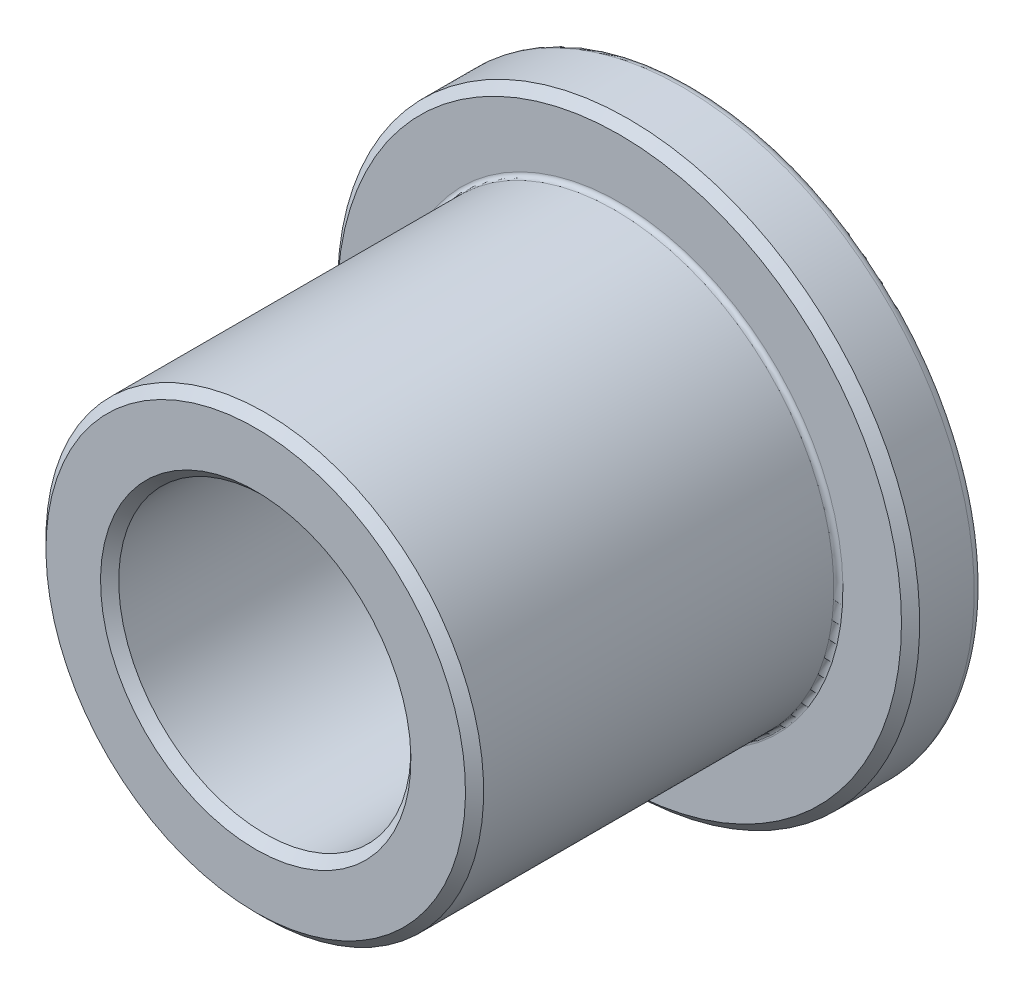
ISO-10303-21;
HEADER;
FILE_DESCRIPTION(('STEP AP214'),'2;1');
FILE_NAME('part.step','',(''),(''),'','','');
FILE_SCHEMA(('AUTOMOTIVE_DESIGN { 1 0 10303 214 1 1 1 1 }'));
ENDSEC;
DATA;
#1=APPLICATION_CONTEXT('core data for automotive mechanical design processes');
#2=APPLICATION_PROTOCOL_DEFINITION('international standard','automotive_design',2000,#1);
#3=PRODUCT_CONTEXT('',#1,'mechanical');
#4=PRODUCT('Part','Part','',(#3));
#5=PRODUCT_RELATED_PRODUCT_CATEGORY('part','',(#4));
#6=PRODUCT_DEFINITION_FORMATION('','',#4);
#7=PRODUCT_DEFINITION_CONTEXT('part definition',#1,'design');
#8=PRODUCT_DEFINITION('design','',#6,#7);
#9=PRODUCT_DEFINITION_SHAPE('','',#8);
#10=(LENGTH_UNIT() NAMED_UNIT(*) SI_UNIT(.MILLI.,.METRE.));
#11=(NAMED_UNIT(*) PLANE_ANGLE_UNIT() SI_UNIT($,.RADIAN.));
#12=(NAMED_UNIT(*) SI_UNIT($,.STERADIAN.) SOLID_ANGLE_UNIT());
#13=UNCERTAINTY_MEASURE_WITH_UNIT(LENGTH_MEASURE(1.E-05),#10,'distance_accuracy_value','');
#14=(GEOMETRIC_REPRESENTATION_CONTEXT(3) GLOBAL_UNCERTAINTY_ASSIGNED_CONTEXT((#13)) GLOBAL_UNIT_ASSIGNED_CONTEXT((#10,
#11,#12)) REPRESENTATION_CONTEXT('',''));
#15=CARTESIAN_POINT('',(0.,0.,0.));
#16=DIRECTION('',(0.,0.,1.));
#17=DIRECTION('',(1.,0.,0.));
#18=AXIS2_PLACEMENT_3D('',#15,#16,#17);
#19=CARTESIAN_POINT('',(0.,6.35,-4.7625));
#20=DIRECTION('',(0.,0.,-1.));
#21=DIRECTION('',(0.,1.,0.));
#22=AXIS2_PLACEMENT_3D('',#19,#20,#21);
#23=PLANE('',#22);
#24=CARTESIAN_POINT('',(0.,0.,-4.7625));
#25=DIRECTION('',(0.,0.,-1.));
#26=DIRECTION('',(0.,1.,0.));
#27=AXIS2_PLACEMENT_3D('',#24,#25,#26);
#28=CIRCLE('',#27,6.1515625);
#29=CARTESIAN_POINT('',(0.,6.1515625,-4.7625));
#30=VERTEX_POINT('',#29);
#31=EDGE_CURVE('E47',#30,#30,#28,.T.);
#32=ORIENTED_EDGE('',*,*,#31,.T.);
#33=EDGE_LOOP('',(#32));
#34=FACE_BOUND('',#33,.T.);
#35=CARTESIAN_POINT('',(0.,0.,-4.7625));
#36=DIRECTION('',(0.,0.,-1.));
#37=DIRECTION('',(0.,1.,0.));
#38=AXIS2_PLACEMENT_3D('',#35,#36,#37);
#39=CIRCLE('',#38,3.1877);
#40=CARTESIAN_POINT('',(0.,3.1877,-4.7625));
#41=VERTEX_POINT('',#40);
#42=EDGE_CURVE('E70',#41,#41,#39,.T.);
#43=ORIENTED_EDGE('',*,*,#42,.F.);
#44=EDGE_LOOP('',(#43));
#45=FACE_BOUND('',#44,.T.);
#46=ADVANCED_FACE('F32',(#34,#45),#23,.T.);
#47=CARTESIAN_POINT('',(0.,0.,-4.7625));
#48=DIRECTION('',(0.,0.,-1.));
#49=DIRECTION('',(0.,1.,0.));
#50=AXIS2_PLACEMENT_3D('',#47,#48,#49);
#51=CYLINDRICAL_SURFACE('',#50,6.35);
#52=CARTESIAN_POINT('',(0.,0.,-4.5640625));
#53=DIRECTION('',(0.,0.,-1.));
#54=DIRECTION('',(0.,1.,0.));
#55=AXIS2_PLACEMENT_3D('',#52,#53,#54);
#56=CIRCLE('',#55,6.35);
#57=CARTESIAN_POINT('',(0.,6.35,-4.5640625));
#58=VERTEX_POINT('',#57);
#59=EDGE_CURVE('E43',#58,#58,#56,.F.);
#60=ORIENTED_EDGE('',*,*,#59,.T.);
#61=EDGE_LOOP('',(#60));
#62=FACE_BOUND('',#61,.T.);
#63=CARTESIAN_POINT('',(0.,0.,-3.37343749999999));
#64=DIRECTION('',(0.,0.,1.));
#65=DIRECTION('',(0.,-1.,0.));
#66=AXIS2_PLACEMENT_3D('',#63,#64,#65);
#67=CIRCLE('',#66,6.35);
#68=CARTESIAN_POINT('',(0.,-6.35,-3.3734375));
#69=VERTEX_POINT('',#68);
#70=EDGE_CURVE('E67',#69,#69,#67,.F.);
#71=ORIENTED_EDGE('',*,*,#70,.T.);
#72=EDGE_LOOP('',(#71));
#73=FACE_BOUND('',#72,.T.);
#74=ADVANCED_FACE('F77',(#62,#73),#51,.T.);
#75=CARTESIAN_POINT('',(0.,6.35,-3.175));
#76=DIRECTION('',(0.,0.,1.));
#77=DIRECTION('',(0.,-1.,0.));
#78=AXIS2_PLACEMENT_3D('',#75,#76,#77);
#79=PLANE('',#78);
#80=CARTESIAN_POINT('',(0.,0.,-3.175));
#81=DIRECTION('',(0.,0.,1.));
#82=DIRECTION('',(0.,-1.,0.));
#83=AXIS2_PLACEMENT_3D('',#80,#81,#82);
#84=CIRCLE('',#83,4.87441875);
#85=CARTESIAN_POINT('',(0.,-4.87441875,-3.175));
#86=VERTEX_POINT('',#85);
#87=EDGE_CURVE('E39',#86,#86,#84,.F.);
#88=ORIENTED_EDGE('',*,*,#87,.T.);
#89=EDGE_LOOP('',(#88));
#90=FACE_BOUND('',#89,.T.);
#91=CARTESIAN_POINT('',(0.,0.,-3.175));
#92=DIRECTION('',(0.,0.,1.));
#93=DIRECTION('',(0.,-1.,0.));
#94=AXIS2_PLACEMENT_3D('',#91,#92,#93);
#95=CIRCLE('',#94,6.1515625);
#96=CARTESIAN_POINT('',(0.,-6.1515625,-3.175));
#97=VERTEX_POINT('',#96);
#98=EDGE_CURVE('E64',#97,#97,#95,.T.);
#99=ORIENTED_EDGE('',*,*,#98,.T.);
#100=EDGE_LOOP('',(#99));
#101=FACE_BOUND('',#100,.T.);
#102=ADVANCED_FACE('F83',(#90,#101),#79,.T.);
#103=CARTESIAN_POINT('',(0.,0.,-4.7625));
#104=DIRECTION('',(0.,0.,-1.));
#105=DIRECTION('',(0.,1.,0.));
#106=AXIS2_PLACEMENT_3D('',#103,#104,#105);
#107=CYLINDRICAL_SURFACE('',#106,4.7752);
#108=CARTESIAN_POINT('',(0.,0.,-3.07578125));
#109=DIRECTION('',(0.,0.,1.));
#110=DIRECTION('',(0.,-1.,0.));
#111=AXIS2_PLACEMENT_3D('',#108,#109,#110);
#112=CIRCLE('',#111,4.7752);
#113=CARTESIAN_POINT('',(0.,-4.7752,-3.07578125));
#114=VERTEX_POINT('',#113);
#115=EDGE_CURVE('E10',#114,#114,#112,.T.);
#116=ORIENTED_EDGE('',*,*,#115,.T.);
#117=EDGE_LOOP('',(#116));
#118=FACE_BOUND('',#117,.T.);
#119=CARTESIAN_POINT('',(0.,0.,4.5640625));
#120=DIRECTION('',(0.,0.,1.));
#121=DIRECTION('',(0.,-1.,0.));
#122=AXIS2_PLACEMENT_3D('',#119,#120,#121);
#123=CIRCLE('',#122,4.7752);
#124=CARTESIAN_POINT('',(0.,-4.7752,4.5640625));
#125=VERTEX_POINT('',#124);
#126=EDGE_CURVE('E61',#125,#125,#123,.F.);
#127=ORIENTED_EDGE('',*,*,#126,.T.);
#128=EDGE_LOOP('',(#127));
#129=FACE_BOUND('',#128,.T.);
#130=ADVANCED_FACE('F121',(#118,#129),#107,.T.);
#131=CARTESIAN_POINT('',(0.,4.7752,4.7625));
#132=DIRECTION('',(0.,0.,1.));
#133=DIRECTION('',(0.,-1.,0.));
#134=AXIS2_PLACEMENT_3D('',#131,#132,#133);
#135=PLANE('',#134);
#136=CARTESIAN_POINT('',(0.,0.,4.7625));
#137=DIRECTION('',(0.,0.,1.));
#138=DIRECTION('',(0.,-1.,0.));
#139=AXIS2_PLACEMENT_3D('',#136,#137,#138);
#140=CIRCLE('',#139,4.5767625);
#141=CARTESIAN_POINT('',(0.,-4.5767625,4.7625));
#142=VERTEX_POINT('',#141);
#143=EDGE_CURVE('E55',#142,#142,#140,.T.);
#144=ORIENTED_EDGE('',*,*,#143,.T.);
#145=EDGE_LOOP('',(#144));
#146=FACE_BOUND('',#145,.T.);
#147=CARTESIAN_POINT('',(0.,0.,4.7625));
#148=DIRECTION('',(0.,0.,1.));
#149=DIRECTION('',(0.,-1.,0.));
#150=AXIS2_PLACEMENT_3D('',#147,#148,#149);
#151=CIRCLE('',#150,3.3861375);
#152=CARTESIAN_POINT('',(0.,-3.3861375,4.7625));
#153=VERTEX_POINT('',#152);
#154=EDGE_CURVE('E58',#153,#153,#151,.F.);
#155=ORIENTED_EDGE('',*,*,#154,.T.);
#156=EDGE_LOOP('',(#155));
#157=FACE_BOUND('',#156,.T.);
#158=ADVANCED_FACE('F126',(#146,#157),#135,.T.);
#159=CARTESIAN_POINT('',(0.,0.,-4.7625));
#160=DIRECTION('',(0.,0.,-1.));
#161=DIRECTION('',(0.,1.,0.));
#162=AXIS2_PLACEMENT_3D('',#159,#160,#161);
#163=CYLINDRICAL_SURFACE('',#162,3.1877);
#164=CARTESIAN_POINT('',(0.,0.,4.5640625));
#165=DIRECTION('',(0.,0.,1.));
#166=DIRECTION('',(0.,-1.,0.));
#167=AXIS2_PLACEMENT_3D('',#164,#165,#166);
#168=CIRCLE('',#167,3.1877);
#169=CARTESIAN_POINT('',(0.,-3.1877,4.5640625));
#170=VERTEX_POINT('',#169);
#171=EDGE_CURVE('E52',#170,#170,#168,.T.);
#172=ORIENTED_EDGE('',*,*,#171,.T.);
#173=EDGE_LOOP('',(#172));
#174=FACE_BOUND('',#173,.T.);
#175=ORIENTED_EDGE('',*,*,#42,.T.);
#176=EDGE_LOOP('',(#175));
#177=FACE_BOUND('',#176,.T.);
#178=ADVANCED_FACE('F74',(#174,#177),#163,.F.);
#179=CARTESIAN_POINT('',(0.,0.,-3.37343749999999));
#180=DIRECTION('',(0.,0.,-1.));
#181=DIRECTION('',(0.,1.,0.));
#182=AXIS2_PLACEMENT_3D('',#179,#180,#181);
#183=CONICAL_SURFACE('',#182,6.35,0.78539816339745);
#184=ORIENTED_EDGE('',*,*,#98,.F.);
#185=EDGE_LOOP('',(#184));
#186=FACE_BOUND('',#185,.T.);
#187=ORIENTED_EDGE('',*,*,#70,.F.);
#188=EDGE_LOOP('',(#187));
#189=FACE_BOUND('',#188,.T.);
#190=ADVANCED_FACE('F88',(#186,#189),#183,.T.);
#191=CARTESIAN_POINT('',(0.,0.,4.5640625));
#192=DIRECTION('',(0.,0.,-1.));
#193=DIRECTION('',(0.,1.,0.));
#194=AXIS2_PLACEMENT_3D('',#191,#192,#193);
#195=CONICAL_SURFACE('',#194,4.7752,0.785398163397448);
#196=ORIENTED_EDGE('',*,*,#143,.F.);
#197=EDGE_LOOP('',(#196));
#198=FACE_BOUND('',#197,.T.);
#199=ORIENTED_EDGE('',*,*,#126,.F.);
#200=EDGE_LOOP('',(#199));
#201=FACE_BOUND('',#200,.T.);
#202=ADVANCED_FACE('F91',(#198,#201),#195,.T.);
#203=CARTESIAN_POINT('',(0.,0.,4.7625));
#204=DIRECTION('',(0.,0.,1.));
#205=DIRECTION('',(0.,-1.,0.));
#206=AXIS2_PLACEMENT_3D('',#203,#204,#205);
#207=CONICAL_SURFACE('',#206,3.3861375,0.785398163397443);
#208=ORIENTED_EDGE('',*,*,#171,.F.);
#209=EDGE_LOOP('',(#208));
#210=FACE_BOUND('',#209,.T.);
#211=ORIENTED_EDGE('',*,*,#154,.F.);
#212=EDGE_LOOP('',(#211));
#213=FACE_BOUND('',#212,.T.);
#214=ADVANCED_FACE('F95',(#210,#213),#207,.F.);
#215=CARTESIAN_POINT('',(0.,0.,-4.5640625));
#216=DIRECTION('',(0.,0.,-1.));
#217=DIRECTION('',(0.,1.,0.));
#218=AXIS2_PLACEMENT_3D('',#215,#216,#217);
#219=TOROIDAL_SURFACE('',#218,6.1515625,0.1984375);
#220=ORIENTED_EDGE('',*,*,#59,.F.);
#221=EDGE_LOOP('',(#220));
#222=FACE_BOUND('',#221,.T.);
#223=ORIENTED_EDGE('',*,*,#31,.F.);
#224=EDGE_LOOP('',(#223));
#225=FACE_BOUND('',#224,.T.);
#226=ADVANCED_FACE('F98',(#222,#225),#219,.T.);
#227=CARTESIAN_POINT('',(0.,0.,-3.07578125));
#228=DIRECTION('',(0.,0.,1.));
#229=DIRECTION('',(0.,-1.,0.));
#230=AXIS2_PLACEMENT_3D('',#227,#228,#229);
#231=TOROIDAL_SURFACE('',#230,4.87441875,0.09921875);
#232=ORIENTED_EDGE('',*,*,#115,.F.);
#233=EDGE_LOOP('',(#232));
#234=FACE_BOUND('',#233,.T.);
#235=ORIENTED_EDGE('',*,*,#87,.F.);
#236=EDGE_LOOP('',(#235));
#237=FACE_BOUND('',#236,.T.);
#238=ADVANCED_FACE('F34',(#234,#237),#231,.F.);
#239=CLOSED_SHELL('',(#46,#74,#102,#130,#158,#178,#190,#202,#214,#226,#238));
#240=MANIFOLD_SOLID_BREP('B2',#239);
#241=ADVANCED_BREP_SHAPE_REPRESENTATION('',(#18,#240),#14);
#242=SHAPE_DEFINITION_REPRESENTATION(#9,#241);
ENDSEC;
END-ISO-10303-21;
